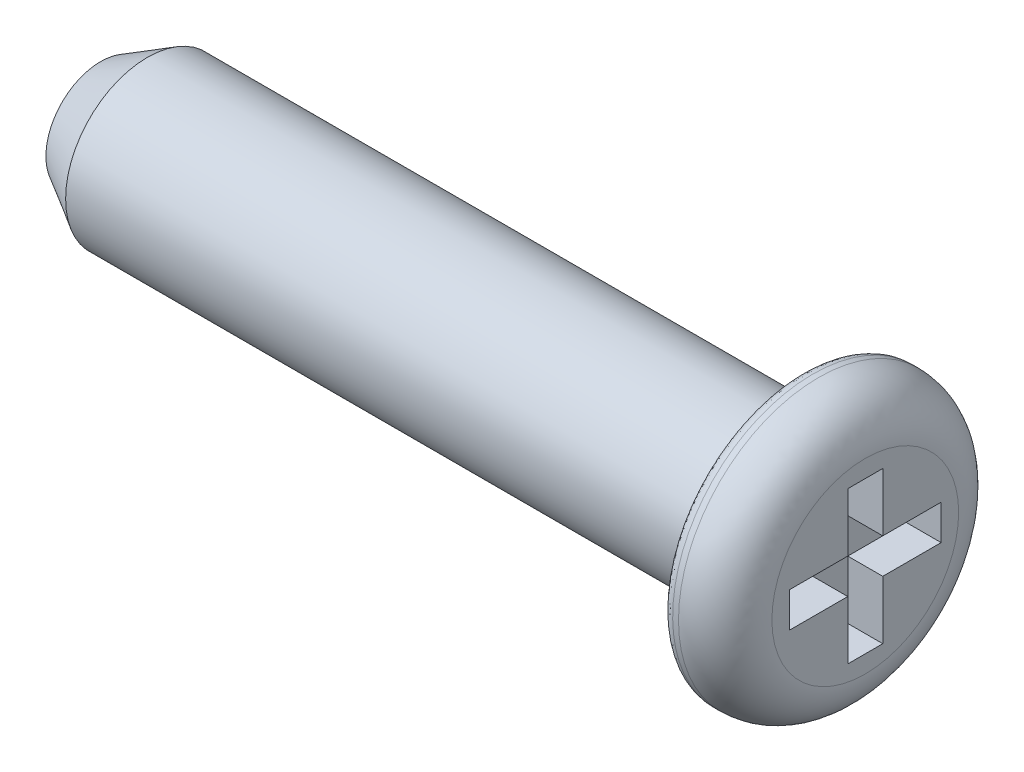
ISO-10303-21;
HEADER;
FILE_DESCRIPTION(('STEP AP214'),'2;1');
FILE_NAME('part.step','',(''),(''),'','','');
FILE_SCHEMA(('AUTOMOTIVE_DESIGN { 1 0 10303 214 1 1 1 1 }'));
ENDSEC;
DATA;
#1=APPLICATION_CONTEXT('core data for automotive mechanical design processes');
#2=APPLICATION_PROTOCOL_DEFINITION('international standard','automotive_design',2000,#1);
#3=PRODUCT_CONTEXT('',#1,'mechanical');
#4=PRODUCT('Part','Part','',(#3));
#5=PRODUCT_RELATED_PRODUCT_CATEGORY('part','',(#4));
#6=PRODUCT_DEFINITION_FORMATION('','',#4);
#7=PRODUCT_DEFINITION_CONTEXT('part definition',#1,'design');
#8=PRODUCT_DEFINITION('design','',#6,#7);
#9=PRODUCT_DEFINITION_SHAPE('','',#8);
#10=(LENGTH_UNIT() NAMED_UNIT(*) SI_UNIT(.MILLI.,.METRE.));
#11=(NAMED_UNIT(*) PLANE_ANGLE_UNIT() SI_UNIT($,.RADIAN.));
#12=(NAMED_UNIT(*) SI_UNIT($,.STERADIAN.) SOLID_ANGLE_UNIT());
#13=UNCERTAINTY_MEASURE_WITH_UNIT(LENGTH_MEASURE(1.E-05),#10,'distance_accuracy_value','');
#14=(GEOMETRIC_REPRESENTATION_CONTEXT(3) GLOBAL_UNCERTAINTY_ASSIGNED_CONTEXT((#13)) GLOBAL_UNIT_ASSIGNED_CONTEXT((#10,
#11,#12)) REPRESENTATION_CONTEXT('',''));
#15=CARTESIAN_POINT('',(0.,0.,0.));
#16=DIRECTION('',(0.,0.,1.));
#17=DIRECTION('',(1.,0.,0.));
#18=AXIS2_PLACEMENT_3D('',#15,#16,#17);
#19=CARTESIAN_POINT('',(6.75,3.024,-5.524));
#20=DIRECTION('',(1.,0.,0.));
#21=DIRECTION('',(0.,0.,-1.));
#22=AXIS2_PLACEMENT_3D('',#19,#20,#21);
#23=PLANE('',#22);
#24=DIRECTION('',(0.,-1.,0.));
#25=VECTOR('',#24,1.);
#26=CARTESIAN_POINT('',(6.75,3.7,-5.55));
#27=LINE('',#26,#25);
#28=CARTESIAN_POINT('',(6.75,3.85,-5.55));
#29=VERTEX_POINT('',#28);
#30=CARTESIAN_POINT('',(6.75,3.55,-5.55));
#31=VERTEX_POINT('',#30);
#32=EDGE_CURVE('E176',#29,#31,#27,.T.);
#33=ORIENTED_EDGE('',*,*,#32,.T.);
#34=DIRECTION('',(0.,0.,-1.));
#35=VECTOR('',#34,1.);
#36=CARTESIAN_POINT('',(6.75,3.55,-5.8));
#37=LINE('',#36,#35);
#38=CARTESIAN_POINT('',(6.75,3.55,-6.05));
#39=VERTEX_POINT('',#38);
#40=EDGE_CURVE('E369',#31,#39,#37,.T.);
#41=ORIENTED_EDGE('',*,*,#40,.T.);
#42=DIRECTION('',(0.,-1.,0.));
#43=VECTOR('',#42,1.);
#44=CARTESIAN_POINT('',(6.75,3.3,-6.05));
#45=LINE('',#44,#43);
#46=CARTESIAN_POINT('',(6.75,3.05,-6.05));
#47=VERTEX_POINT('',#46);
#48=EDGE_CURVE('E362',#39,#47,#45,.T.);
#49=ORIENTED_EDGE('',*,*,#48,.T.);
#50=DIRECTION('',(0.,0.,-1.));
#51=VECTOR('',#50,1.);
#52=CARTESIAN_POINT('',(6.75,3.05,-6.2));
#53=LINE('',#52,#51);
#54=CARTESIAN_POINT('',(6.75,3.05,-6.35));
#55=VERTEX_POINT('',#54);
#56=EDGE_CURVE('E355',#47,#55,#53,.T.);
#57=ORIENTED_EDGE('',*,*,#56,.T.);
#58=DIRECTION('',(0.,1.,0.));
#59=VECTOR('',#58,1.);
#60=CARTESIAN_POINT('',(6.75,3.3,-6.35));
#61=LINE('',#60,#59);
#62=CARTESIAN_POINT('',(6.75,3.55,-6.35));
#63=VERTEX_POINT('',#62);
#64=EDGE_CURVE('E348',#55,#63,#61,.T.);
#65=ORIENTED_EDGE('',*,*,#64,.T.);
#66=DIRECTION('',(0.,0.,-1.));
#67=VECTOR('',#66,1.);
#68=CARTESIAN_POINT('',(6.75,3.55,-6.6));
#69=LINE('',#68,#67);
#70=CARTESIAN_POINT('',(6.75,3.55,-6.85));
#71=VERTEX_POINT('',#70);
#72=EDGE_CURVE('E341',#63,#71,#69,.T.);
#73=ORIENTED_EDGE('',*,*,#72,.T.);
#74=DIRECTION('',(0.,1.,0.));
#75=VECTOR('',#74,1.);
#76=CARTESIAN_POINT('',(6.75,3.7,-6.85));
#77=LINE('',#76,#75);
#78=CARTESIAN_POINT('',(6.75,3.85,-6.85));
#79=VERTEX_POINT('',#78);
#80=EDGE_CURVE('E334',#71,#79,#77,.T.);
#81=ORIENTED_EDGE('',*,*,#80,.T.);
#82=DIRECTION('',(0.,0.,1.));
#83=VECTOR('',#82,1.);
#84=CARTESIAN_POINT('',(6.75,3.85,-6.6));
#85=LINE('',#84,#83);
#86=CARTESIAN_POINT('',(6.75,3.85,-6.35));
#87=VERTEX_POINT('',#86);
#88=EDGE_CURVE('E327',#79,#87,#85,.T.);
#89=ORIENTED_EDGE('',*,*,#88,.T.);
#90=DIRECTION('',(0.,1.,0.));
#91=VECTOR('',#90,1.);
#92=CARTESIAN_POINT('',(6.75,4.1,-6.35));
#93=LINE('',#92,#91);
#94=CARTESIAN_POINT('',(6.75,4.35,-6.35));
#95=VERTEX_POINT('',#94);
#96=EDGE_CURVE('E320',#87,#95,#93,.T.);
#97=ORIENTED_EDGE('',*,*,#96,.T.);
#98=DIRECTION('',(0.,0.,1.));
#99=VECTOR('',#98,1.);
#100=CARTESIAN_POINT('',(6.75,4.35,-6.2));
#101=LINE('',#100,#99);
#102=CARTESIAN_POINT('',(6.75,4.35,-6.05));
#103=VERTEX_POINT('',#102);
#104=EDGE_CURVE('E153',#95,#103,#101,.T.);
#105=ORIENTED_EDGE('',*,*,#104,.T.);
#106=DIRECTION('',(0.,-1.,0.));
#107=VECTOR('',#106,1.);
#108=CARTESIAN_POINT('',(6.75,4.1,-6.05));
#109=LINE('',#108,#107);
#110=CARTESIAN_POINT('',(6.75,3.85,-6.05));
#111=VERTEX_POINT('',#110);
#112=EDGE_CURVE('E150',#103,#111,#109,.T.);
#113=ORIENTED_EDGE('',*,*,#112,.T.);
#114=DIRECTION('',(0.,0.,1.));
#115=VECTOR('',#114,1.);
#116=CARTESIAN_POINT('',(6.75,3.85,-5.8));
#117=LINE('',#116,#115);
#118=EDGE_CURVE('E146',#111,#29,#117,.T.);
#119=ORIENTED_EDGE('',*,*,#118,.T.);
#120=EDGE_LOOP('',(#33,#41,#49,#57,#65,#73,#81,#89,#97,#105,#113,#119));
#121=FACE_BOUND('',#120,.T.);
#122=ADVANCED_FACE('F16',(#121),#23,.T.);
#123=CARTESIAN_POINT('',(6.741146467985,4.36,-6.05));
#124=DIRECTION('',(0.,0.,1.));
#125=DIRECTION('',(0.,-1.,0.));
#126=AXIS2_PLACEMENT_3D('',#123,#124,#125);
#127=PLANE('',#126);
#128=ORIENTED_EDGE('',*,*,#112,.F.);
#129=DIRECTION('',(1.,0.,0.));
#130=VECTOR('',#129,1.);
#131=CARTESIAN_POINT('',(6.9,4.35,-6.05));
#132=LINE('',#131,#130);
#133=CARTESIAN_POINT('',(7.05,4.35,-6.05));
#134=VERTEX_POINT('',#133);
#135=EDGE_CURVE('E306',#103,#134,#132,.T.);
#136=ORIENTED_EDGE('',*,*,#135,.T.);
#137=DIRECTION('',(0.,1.,0.));
#138=VECTOR('',#137,1.);
#139=CARTESIAN_POINT('',(7.05,3.7,-6.05));
#140=LINE('',#139,#138);
#141=CARTESIAN_POINT('',(7.05,3.85,-6.05));
#142=VERTEX_POINT('',#141);
#143=EDGE_CURVE('E162',#134,#142,#140,.F.);
#144=ORIENTED_EDGE('',*,*,#143,.T.);
#145=DIRECTION('',(-1.,0.,0.));
#146=VECTOR('',#145,1.);
#147=CARTESIAN_POINT('',(6.9,3.85,-6.05));
#148=LINE('',#147,#146);
#149=EDGE_CURVE('E157',#142,#111,#148,.T.);
#150=ORIENTED_EDGE('',*,*,#149,.T.);
#151=EDGE_LOOP('',(#128,#136,#144,#150));
#152=FACE_BOUND('',#151,.T.);
#153=ADVANCED_FACE('F160',(#152),#127,.F.);
#154=CARTESIAN_POINT('',(6.741146467985,3.85,-6.06));
#155=DIRECTION('',(0.,1.,0.));
#156=DIRECTION('',(0.,0.,1.));
#157=AXIS2_PLACEMENT_3D('',#154,#155,#156);
#158=PLANE('',#157);
#159=ORIENTED_EDGE('',*,*,#118,.F.);
#160=ORIENTED_EDGE('',*,*,#149,.F.);
#161=DIRECTION('',(0.,0.,-1.));
#162=VECTOR('',#161,1.);
#163=CARTESIAN_POINT('',(7.05,3.85,-6.2));
#164=LINE('',#163,#162);
#165=CARTESIAN_POINT('',(7.05,3.85,-5.55));
#166=VERTEX_POINT('',#165);
#167=EDGE_CURVE('E431',#142,#166,#164,.F.);
#168=ORIENTED_EDGE('',*,*,#167,.T.);
#169=DIRECTION('',(-1.,0.,0.));
#170=VECTOR('',#169,1.);
#171=CARTESIAN_POINT('',(6.9,3.85,-5.55));
#172=LINE('',#171,#170);
#173=EDGE_CURVE('E169',#166,#29,#172,.T.);
#174=ORIENTED_EDGE('',*,*,#173,.T.);
#175=EDGE_LOOP('',(#159,#160,#168,#174));
#176=FACE_BOUND('',#175,.T.);
#177=ADVANCED_FACE('F167',(#176),#158,.F.);
#178=CARTESIAN_POINT('',(6.741146467985,3.858853532015,-5.55));
#179=DIRECTION('',(0.,0.,1.));
#180=DIRECTION('',(0.,-1.,0.));
#181=AXIS2_PLACEMENT_3D('',#178,#179,#180);
#182=PLANE('',#181);
#183=ORIENTED_EDGE('',*,*,#32,.F.);
#184=ORIENTED_EDGE('',*,*,#173,.F.);
#185=DIRECTION('',(0.,1.,0.));
#186=VECTOR('',#185,1.);
#187=CARTESIAN_POINT('',(7.05,3.7,-5.55));
#188=LINE('',#187,#186);
#189=CARTESIAN_POINT('',(7.05,3.55,-5.55));
#190=VERTEX_POINT('',#189);
#191=EDGE_CURVE('E381',#166,#190,#188,.F.);
#192=ORIENTED_EDGE('',*,*,#191,.T.);
#193=DIRECTION('',(-1.,0.,0.));
#194=VECTOR('',#193,1.);
#195=CARTESIAN_POINT('',(6.9,3.55,-5.55));
#196=LINE('',#195,#194);
#197=EDGE_CURVE('E372',#190,#31,#196,.T.);
#198=ORIENTED_EDGE('',*,*,#197,.T.);
#199=EDGE_LOOP('',(#183,#184,#192,#198));
#200=FACE_BOUND('',#199,.T.);
#201=ADVANCED_FACE('F379',(#200),#182,.F.);
#202=CARTESIAN_POINT('',(6.741146467985,3.55,-5.54));
#203=DIRECTION('',(0.,-1.,0.));
#204=DIRECTION('',(0.,0.,-1.));
#205=AXIS2_PLACEMENT_3D('',#202,#203,#204);
#206=PLANE('',#205);
#207=ORIENTED_EDGE('',*,*,#40,.F.);
#208=ORIENTED_EDGE('',*,*,#197,.F.);
#209=DIRECTION('',(0.,0.,1.));
#210=VECTOR('',#209,1.);
#211=CARTESIAN_POINT('',(7.05,3.55,-6.2));
#212=LINE('',#211,#210);
#213=CARTESIAN_POINT('',(7.05,3.55,-6.05));
#214=VERTEX_POINT('',#213);
#215=EDGE_CURVE('E387',#190,#214,#212,.F.);
#216=ORIENTED_EDGE('',*,*,#215,.T.);
#217=DIRECTION('',(-1.,0.,0.));
#218=VECTOR('',#217,1.);
#219=CARTESIAN_POINT('',(6.9,3.55,-6.05));
#220=LINE('',#219,#218);
#221=EDGE_CURVE('E365',#214,#39,#220,.T.);
#222=ORIENTED_EDGE('',*,*,#221,.T.);
#223=EDGE_LOOP('',(#207,#208,#216,#222));
#224=FACE_BOUND('',#223,.T.);
#225=ADVANCED_FACE('F384',(#224),#206,.F.);
#226=CARTESIAN_POINT('',(6.741146467985,3.56,-6.05));
#227=DIRECTION('',(0.,0.,1.));
#228=DIRECTION('',(0.,-1.,0.));
#229=AXIS2_PLACEMENT_3D('',#226,#227,#228);
#230=PLANE('',#229);
#231=ORIENTED_EDGE('',*,*,#48,.F.);
#232=ORIENTED_EDGE('',*,*,#221,.F.);
#233=DIRECTION('',(0.,1.,0.));
#234=VECTOR('',#233,1.);
#235=CARTESIAN_POINT('',(7.05,3.7,-6.05));
#236=LINE('',#235,#234);
#237=CARTESIAN_POINT('',(7.05,3.05,-6.05));
#238=VERTEX_POINT('',#237);
#239=EDGE_CURVE('E440',#214,#238,#236,.F.);
#240=ORIENTED_EDGE('',*,*,#239,.T.);
#241=DIRECTION('',(-1.,0.,0.));
#242=VECTOR('',#241,1.);
#243=CARTESIAN_POINT('',(6.9,3.05,-6.05));
#244=LINE('',#243,#242);
#245=EDGE_CURVE('E358',#238,#47,#244,.T.);
#246=ORIENTED_EDGE('',*,*,#245,.T.);
#247=EDGE_LOOP('',(#231,#232,#240,#246));
#248=FACE_BOUND('',#247,.T.);
#249=ADVANCED_FACE('F390',(#248),#230,.F.);
#250=CARTESIAN_POINT('',(6.741146467985,3.05,-6.041146467985));
#251=DIRECTION('',(0.,-1.,0.));
#252=DIRECTION('',(0.,0.,-1.));
#253=AXIS2_PLACEMENT_3D('',#250,#251,#252);
#254=PLANE('',#253);
#255=ORIENTED_EDGE('',*,*,#56,.F.);
#256=ORIENTED_EDGE('',*,*,#245,.F.);
#257=DIRECTION('',(0.,0.,1.));
#258=VECTOR('',#257,1.);
#259=CARTESIAN_POINT('',(7.05,3.05,-6.2));
#260=LINE('',#259,#258);
#261=CARTESIAN_POINT('',(7.05,3.05,-6.35));
#262=VERTEX_POINT('',#261);
#263=EDGE_CURVE('E398',#238,#262,#260,.F.);
#264=ORIENTED_EDGE('',*,*,#263,.T.);
#265=DIRECTION('',(-1.,0.,0.));
#266=VECTOR('',#265,1.);
#267=CARTESIAN_POINT('',(6.9,3.05,-6.35));
#268=LINE('',#267,#266);
#269=EDGE_CURVE('E351',#262,#55,#268,.T.);
#270=ORIENTED_EDGE('',*,*,#269,.T.);
#271=EDGE_LOOP('',(#255,#256,#264,#270));
#272=FACE_BOUND('',#271,.T.);
#273=ADVANCED_FACE('F396',(#272),#254,.F.);
#274=CARTESIAN_POINT('',(6.741146467985,3.04,-6.35));
#275=DIRECTION('',(0.,0.,-1.));
#276=DIRECTION('',(0.,1.,0.));
#277=AXIS2_PLACEMENT_3D('',#274,#275,#276);
#278=PLANE('',#277);
#279=ORIENTED_EDGE('',*,*,#64,.F.);
#280=ORIENTED_EDGE('',*,*,#269,.F.);
#281=DIRECTION('',(0.,-1.,0.));
#282=VECTOR('',#281,1.);
#283=CARTESIAN_POINT('',(7.05,3.7,-6.35));
#284=LINE('',#283,#282);
#285=CARTESIAN_POINT('',(7.05,3.55,-6.35));
#286=VERTEX_POINT('',#285);
#287=EDGE_CURVE('E404',#262,#286,#284,.F.);
#288=ORIENTED_EDGE('',*,*,#287,.T.);
#289=DIRECTION('',(-1.,0.,0.));
#290=VECTOR('',#289,1.);
#291=CARTESIAN_POINT('',(6.9,3.55,-6.35));
#292=LINE('',#291,#290);
#293=EDGE_CURVE('E344',#286,#63,#292,.T.);
#294=ORIENTED_EDGE('',*,*,#293,.T.);
#295=EDGE_LOOP('',(#279,#280,#288,#294));
#296=FACE_BOUND('',#295,.T.);
#297=ADVANCED_FACE('F401',(#296),#278,.F.);
#298=CARTESIAN_POINT('',(6.741146467985,3.55,-6.34));
#299=DIRECTION('',(0.,-1.,0.));
#300=DIRECTION('',(0.,0.,-1.));
#301=AXIS2_PLACEMENT_3D('',#298,#299,#300);
#302=PLANE('',#301);
#303=ORIENTED_EDGE('',*,*,#72,.F.);
#304=ORIENTED_EDGE('',*,*,#293,.F.);
#305=DIRECTION('',(0.,0.,1.));
#306=VECTOR('',#305,1.);
#307=CARTESIAN_POINT('',(7.05,3.55,-6.2));
#308=LINE('',#307,#306);
#309=CARTESIAN_POINT('',(7.05,3.55,-6.85));
#310=VERTEX_POINT('',#309);
#311=EDGE_CURVE('E447',#286,#310,#308,.F.);
#312=ORIENTED_EDGE('',*,*,#311,.T.);
#313=DIRECTION('',(-1.,0.,0.));
#314=VECTOR('',#313,1.);
#315=CARTESIAN_POINT('',(6.9,3.55,-6.85));
#316=LINE('',#315,#314);
#317=EDGE_CURVE('E337',#310,#71,#316,.T.);
#318=ORIENTED_EDGE('',*,*,#317,.T.);
#319=EDGE_LOOP('',(#303,#304,#312,#318));
#320=FACE_BOUND('',#319,.T.);
#321=ADVANCED_FACE('F407',(#320),#302,.F.);
#322=CARTESIAN_POINT('',(6.741146467985,3.541146467985,-6.85));
#323=DIRECTION('',(0.,0.,-1.));
#324=DIRECTION('',(0.,1.,0.));
#325=AXIS2_PLACEMENT_3D('',#322,#323,#324);
#326=PLANE('',#325);
#327=ORIENTED_EDGE('',*,*,#80,.F.);
#328=ORIENTED_EDGE('',*,*,#317,.F.);
#329=DIRECTION('',(0.,-1.,0.));
#330=VECTOR('',#329,1.);
#331=CARTESIAN_POINT('',(7.05,3.7,-6.85));
#332=LINE('',#331,#330);
#333=CARTESIAN_POINT('',(7.05,3.85,-6.85));
#334=VERTEX_POINT('',#333);
#335=EDGE_CURVE('E415',#310,#334,#332,.F.);
#336=ORIENTED_EDGE('',*,*,#335,.T.);
#337=DIRECTION('',(-1.,0.,0.));
#338=VECTOR('',#337,1.);
#339=CARTESIAN_POINT('',(6.9,3.85,-6.85));
#340=LINE('',#339,#338);
#341=EDGE_CURVE('E330',#334,#79,#340,.T.);
#342=ORIENTED_EDGE('',*,*,#341,.T.);
#343=EDGE_LOOP('',(#327,#328,#336,#342));
#344=FACE_BOUND('',#343,.T.);
#345=ADVANCED_FACE('F413',(#344),#326,.F.);
#346=CARTESIAN_POINT('',(6.741146467985,3.85,-6.86));
#347=DIRECTION('',(0.,1.,0.));
#348=DIRECTION('',(0.,0.,1.));
#349=AXIS2_PLACEMENT_3D('',#346,#347,#348);
#350=PLANE('',#349);
#351=ORIENTED_EDGE('',*,*,#88,.F.);
#352=ORIENTED_EDGE('',*,*,#341,.F.);
#353=DIRECTION('',(0.,0.,-1.));
#354=VECTOR('',#353,1.);
#355=CARTESIAN_POINT('',(7.05,3.85,-6.2));
#356=LINE('',#355,#354);
#357=CARTESIAN_POINT('',(7.05,3.85,-6.35));
#358=VERTEX_POINT('',#357);
#359=EDGE_CURVE('E421',#334,#358,#356,.F.);
#360=ORIENTED_EDGE('',*,*,#359,.T.);
#361=DIRECTION('',(-1.,0.,0.));
#362=VECTOR('',#361,1.);
#363=CARTESIAN_POINT('',(6.9,3.85,-6.35));
#364=LINE('',#363,#362);
#365=EDGE_CURVE('E323',#358,#87,#364,.T.);
#366=ORIENTED_EDGE('',*,*,#365,.T.);
#367=EDGE_LOOP('',(#351,#352,#360,#366));
#368=FACE_BOUND('',#367,.T.);
#369=ADVANCED_FACE('F418',(#368),#350,.F.);
#370=CARTESIAN_POINT('',(6.741146467985,3.84,-6.35));
#371=DIRECTION('',(0.,0.,-1.));
#372=DIRECTION('',(0.,1.,0.));
#373=AXIS2_PLACEMENT_3D('',#370,#371,#372);
#374=PLANE('',#373);
#375=ORIENTED_EDGE('',*,*,#96,.F.);
#376=ORIENTED_EDGE('',*,*,#365,.F.);
#377=DIRECTION('',(0.,-1.,0.));
#378=VECTOR('',#377,1.);
#379=CARTESIAN_POINT('',(7.05,3.7,-6.35));
#380=LINE('',#379,#378);
#381=CARTESIAN_POINT('',(7.05,4.35,-6.35));
#382=VERTEX_POINT('',#381);
#383=EDGE_CURVE('E426',#358,#382,#380,.F.);
#384=ORIENTED_EDGE('',*,*,#383,.T.);
#385=DIRECTION('',(-1.,0.,0.));
#386=VECTOR('',#385,1.);
#387=CARTESIAN_POINT('',(6.9,4.35,-6.35));
#388=LINE('',#387,#386);
#389=EDGE_CURVE('E316',#382,#95,#388,.T.);
#390=ORIENTED_EDGE('',*,*,#389,.T.);
#391=EDGE_LOOP('',(#375,#376,#384,#390));
#392=FACE_BOUND('',#391,.T.);
#393=ADVANCED_FACE('F424',(#392),#374,.F.);
#394=CARTESIAN_POINT('',(6.741146467985,4.35,-6.358853532015));
#395=DIRECTION('',(0.,1.,0.));
#396=DIRECTION('',(0.,0.,1.));
#397=AXIS2_PLACEMENT_3D('',#394,#395,#396);
#398=PLANE('',#397);
#399=ORIENTED_EDGE('',*,*,#104,.F.);
#400=ORIENTED_EDGE('',*,*,#389,.F.);
#401=DIRECTION('',(0.,0.,-1.));
#402=VECTOR('',#401,1.);
#403=CARTESIAN_POINT('',(7.05,4.35,-6.2));
#404=LINE('',#403,#402);
#405=EDGE_CURVE('E289',#382,#134,#404,.F.);
#406=ORIENTED_EDGE('',*,*,#405,.T.);
#407=ORIENTED_EDGE('',*,*,#135,.F.);
#408=EDGE_LOOP('',(#399,#400,#406,#407));
#409=FACE_BOUND('',#408,.T.);
#410=ADVANCED_FACE('F200',(#409),#398,.F.);
#411=CARTESIAN_POINT('',(7.05,2.867166420633,-5.368));
#412=DIRECTION('',(1.,0.,0.));
#413=DIRECTION('',(0.,0.,-1.));
#414=AXIS2_PLACEMENT_3D('',#411,#412,#413);
#415=PLANE('',#414);
#416=ORIENTED_EDGE('',*,*,#383,.F.);
#417=ORIENTED_EDGE('',*,*,#359,.F.);
#418=ORIENTED_EDGE('',*,*,#335,.F.);
#419=ORIENTED_EDGE('',*,*,#311,.F.);
#420=ORIENTED_EDGE('',*,*,#287,.F.);
#421=ORIENTED_EDGE('',*,*,#263,.F.);
#422=ORIENTED_EDGE('',*,*,#239,.F.);
#423=ORIENTED_EDGE('',*,*,#215,.F.);
#424=ORIENTED_EDGE('',*,*,#191,.F.);
#425=ORIENTED_EDGE('',*,*,#167,.F.);
#426=ORIENTED_EDGE('',*,*,#143,.F.);
#427=ORIENTED_EDGE('',*,*,#405,.F.);
#428=EDGE_LOOP('',(#416,#417,#418,#419,#420,#421,#422,#423,#424,#425,#426,#427));
#429=FACE_BOUND('',#428,.T.);
#430=CARTESIAN_POINT('',(7.05000000000001,3.7,-6.2));
#431=DIRECTION('',(-1.,0.,0.));
#432=DIRECTION('',(0.,0.,-1.));
#433=AXIS2_PLACEMENT_3D('',#430,#431,#432);
#434=CIRCLE('',#433,0.799999991004701);
#435=CARTESIAN_POINT('',(7.05000000000001,3.69999999999999,-5.4000000080958));
#436=VERTEX_POINT('',#435);
#437=CARTESIAN_POINT('',(7.05000000000001,3.70000000000002,-6.9999999919042));
#438=VERTEX_POINT('',#437);
#439=EDGE_CURVE('E183',#436,#438,#434,.F.);
#440=ORIENTED_EDGE('',*,*,#439,.T.);
#441=CARTESIAN_POINT('',(7.05000000000001,3.7,-6.2));
#442=DIRECTION('',(-1.,0.,0.));
#443=DIRECTION('',(0.,0.,1.));
#444=AXIS2_PLACEMENT_3D('',#441,#442,#443);
#445=CIRCLE('',#444,0.799999991004699);
#446=EDGE_CURVE('E284',#438,#436,#445,.F.);
#447=ORIENTED_EDGE('',*,*,#446,.T.);
#448=EDGE_LOOP('',(#440,#447));
#449=FACE_BOUND('',#448,.T.);
#450=ADVANCED_FACE('F190',(#429,#449),#415,.T.);
#451=CARTESIAN_POINT('',(6.63743568920142,3.68865757276304,-7.39974900946468));
#452=CARTESIAN_POINT('',(6.88347384142366,3.68858447708785,-7.40748072879281));
#453=CARTESIAN_POINT('',(7.05753489804068,3.69022997827261,-7.2334272942651));
#454=CARTESIAN_POINT('',(7.04980261265878,3.69255591897725,-6.98740014344981));
#455=(BOUNDED_CURVE() B_SPLINE_CURVE(3,(#451,#452,#453,#454),.UNSPECIFIED.,.F.,
.F.) B_SPLINE_CURVE_WITH_KNOTS((4,4),(0.,1.),
.UNSPECIFIED.) CURVE() GEOMETRIC_REPRESENTATION_ITEM() RATIONAL_B_SPLINE_CURVE((1.,
0.789697844101267,0.789697844101267,1.)) REPRESENTATION_ITEM(''));
#456=CARTESIAN_POINT('',(6.65,3.7,-6.2));
#457=DIRECTION('',(1.,0.,0.));
#458=AXIS1_PLACEMENT('',#456,#457);
#459=SURFACE_OF_REVOLUTION('',#455,#458);
#460=CARTESIAN_POINT('',(6.65,3.7,-6.2));
#461=DIRECTION('',(1.,0.,0.));
#462=DIRECTION('',(0.,0.,-1.));
#463=AXIS2_PLACEMENT_3D('',#460,#461,#462);
#464=CIRCLE('',#463,1.2);
#465=CARTESIAN_POINT('',(6.65,3.7,-7.4));
#466=VERTEX_POINT('',#465);
#467=EDGE_CURVE('E280',#466,#466,#464,.T.);
#468=ORIENTED_EDGE('',*,*,#467,.T.);
#469=EDGE_LOOP('',(#468));
#470=FACE_BOUND('',#469,.T.);
#471=ORIENTED_EDGE('',*,*,#439,.F.);
#472=ORIENTED_EDGE('',*,*,#446,.F.);
#473=EDGE_LOOP('',(#471,#472));
#474=FACE_BOUND('',#473,.T.);
#475=ADVANCED_FACE('F199',(#470,#474),#459,.T.);
#476=CARTESIAN_POINT('',(6.6,3.7,-6.2));
#477=DIRECTION('',(1.,0.,0.));
#478=DIRECTION('',(0.,1.,0.));
#479=AXIS2_PLACEMENT_3D('',#476,#477,#478);
#480=CYLINDRICAL_SURFACE('',#479,1.2);
#481=CARTESIAN_POINT('',(6.6,3.7,-6.2));
#482=DIRECTION('',(1.,0.,0.));
#483=DIRECTION('',(0.,-0.0134291293990491,0.999909825176042));
#484=AXIS2_PLACEMENT_3D('',#481,#482,#483);
#485=CIRCLE('',#484,1.20000000000035);
#486=CARTESIAN_POINT('',(6.6,3.68388504472114,-5.0001082097884));
#487=VERTEX_POINT('',#486);
#488=EDGE_CURVE('E276',#487,#487,#485,.T.);
#489=ORIENTED_EDGE('',*,*,#488,.T.);
#490=EDGE_LOOP('',(#489));
#491=FACE_BOUND('',#490,.T.);
#492=ORIENTED_EDGE('',*,*,#467,.F.);
#493=EDGE_LOOP('',(#492));
#494=FACE_BOUND('',#493,.T.);
#495=ADVANCED_FACE('F252',(#491,#494),#480,.T.);
#496=CARTESIAN_POINT('',(6.50039170687413,3.68534670332098,-5.10894078944785));
#497=CARTESIAN_POINT('',(6.49445300850722,3.68444831367663,-5.04204824522114));
#498=CARTESIAN_POINT('',(6.54194336804711,3.68381055677614,-4.99456196581039));
#499=CARTESIAN_POINT('',(6.60884197014127,3.68389030449755,-5.00049984367342));
#500=(BOUNDED_CURVE() B_SPLINE_CURVE(3,(#496,#497,#498,#499),.UNSPECIFIED.,.F.,
.F.) B_SPLINE_CURVE_WITH_KNOTS((4,4),(0.,1.),
.UNSPECIFIED.) CURVE() GEOMETRIC_REPRESENTATION_ITEM() RATIONAL_B_SPLINE_CURVE((1.,
0.761208971798789,0.761208971798789,1.)) REPRESENTATION_ITEM(''));
#501=CARTESIAN_POINT('',(6.6,3.7,-6.2));
#502=DIRECTION('',(1.,0.,0.));
#503=AXIS1_PLACEMENT('',#501,#502);
#504=SURFACE_OF_REVOLUTION('',#500,#503);
#505=ORIENTED_EDGE('',*,*,#488,.F.);
#506=EDGE_LOOP('',(#505));
#507=FACE_BOUND('',#506,.T.);
#508=CARTESIAN_POINT('',(6.5,3.7,-6.2));
#509=DIRECTION('',(1.,0.,0.));
#510=DIRECTION('',(0.,0.,1.));
#511=AXIS2_PLACEMENT_3D('',#508,#509,#510);
#512=CIRCLE('',#511,1.09999998207468);
#513=CARTESIAN_POINT('',(6.5,3.69999999999998,-5.10000002509559));
#514=VERTEX_POINT('',#513);
#515=CARTESIAN_POINT('',(6.5,3.70000000000001,-7.29999997490441));
#516=VERTEX_POINT('',#515);
#517=EDGE_CURVE('E40',#514,#516,#512,.T.);
#518=ORIENTED_EDGE('',*,*,#517,.T.);
#519=CARTESIAN_POINT('',(6.5,3.7,-6.2));
#520=DIRECTION('',(1.,0.,0.));
#521=DIRECTION('',(0.,0.,-1.));
#522=AXIS2_PLACEMENT_3D('',#519,#520,#521);
#523=CIRCLE('',#522,1.09999998207468);
#524=EDGE_CURVE('E225',#516,#514,#523,.T.);
#525=ORIENTED_EDGE('',*,*,#524,.T.);
#526=EDGE_LOOP('',(#518,#525));
#527=FACE_BOUND('',#526,.T.);
#528=ADVANCED_FACE('F241',(#507,#527),#504,.T.);
#529=CARTESIAN_POINT('',(6.5,2.555999997477,-5.056));
#530=DIRECTION('',(1.,0.,0.));
#531=DIRECTION('',(0.,0.,-1.));
#532=AXIS2_PLACEMENT_3D('',#529,#530,#531);
#533=PLANE('',#532);
#534=CARTESIAN_POINT('',(6.5,3.7,-6.2));
#535=DIRECTION('',(-1.,0.,0.));
#536=DIRECTION('',(0.,0.,1.));
#537=AXIS2_PLACEMENT_3D('',#534,#535,#536);
#538=CIRCLE('',#537,0.7);
#539=CARTESIAN_POINT('',(6.5,3.7,-5.5));
#540=VERTEX_POINT('',#539);
#541=EDGE_CURVE('E234',#540,#540,#538,.F.);
#542=ORIENTED_EDGE('',*,*,#541,.T.);
#543=EDGE_LOOP('',(#542));
#544=FACE_BOUND('',#543,.T.);
#545=ORIENTED_EDGE('',*,*,#517,.F.);
#546=ORIENTED_EDGE('',*,*,#524,.F.);
#547=EDGE_LOOP('',(#545,#546));
#548=FACE_BOUND('',#547,.T.);
#549=ADVANCED_FACE('F203',(#544,#548),#533,.F.);
#550=CARTESIAN_POINT('',(6.5,3.7,-6.2));
#551=DIRECTION('',(-1.,0.,0.));
#552=DIRECTION('',(0.,0.,1.));
#553=AXIS2_PLACEMENT_3D('',#550,#551,#552);
#554=CYLINDRICAL_SURFACE('',#553,0.7);
#555=CARTESIAN_POINT('',(0.899999999999792,3.7,-6.2));
#556=DIRECTION('',(-1.,0.,0.));
#557=DIRECTION('',(0.,-1.,0.));
#558=AXIS2_PLACEMENT_3D('',#555,#556,#557);
#559=CIRCLE('',#558,0.70000000000036);
#560=CARTESIAN_POINT('',(0.899999999999792,2.99999999999964,-6.2));
#561=VERTEX_POINT('',#560);
#562=EDGE_CURVE('E29',#561,#561,#559,.F.);
#563=ORIENTED_EDGE('',*,*,#562,.T.);
#564=EDGE_LOOP('',(#563));
#565=FACE_BOUND('',#564,.T.);
#566=ORIENTED_EDGE('',*,*,#541,.F.);
#567=EDGE_LOOP('',(#566));
#568=FACE_BOUND('',#567,.T.);
#569=ADVANCED_FACE('F254',(#565,#568),#554,.T.);
#570=CARTESIAN_POINT('',(0.899999999999792,3.7,-6.2));
#571=DIRECTION('',(1.,0.,0.));
#572=DIRECTION('',(0.,0.,-1.));
#573=AXIS2_PLACEMENT_3D('',#570,#571,#572);
#574=CONICAL_SURFACE('',#573,0.700000000000361,0.523598775598507);
#575=ORIENTED_EDGE('',*,*,#562,.F.);
#576=EDGE_LOOP('',(#575));
#577=FACE_BOUND('',#576,.T.);
#578=CARTESIAN_POINT('',(0.499999999999818,3.7,-6.2));
#579=DIRECTION('',(1.,0.,0.));
#580=DIRECTION('',(0.,0.,-1.));
#581=AXIS2_PLACEMENT_3D('',#578,#579,#580);
#582=CIRCLE('',#581,0.469059892324415);
#583=CARTESIAN_POINT('',(0.499999999999818,3.7,-6.66905989232442));
#584=VERTEX_POINT('',#583);
#585=EDGE_CURVE('E11',#584,#584,#582,.T.);
#586=ORIENTED_EDGE('',*,*,#585,.T.);
#587=EDGE_LOOP('',(#586));
#588=FACE_BOUND('',#587,.T.);
#589=ADVANCED_FACE('F466',(#577,#588),#574,.T.);
#590=CARTESIAN_POINT('',(0.5,4.187822288017,-6.687822288017));
#591=DIRECTION('',(-1.,0.,0.));
#592=DIRECTION('',(0.,-1.,0.));
#593=AXIS2_PLACEMENT_3D('',#590,#591,#592);
#594=PLANE('',#593);
#595=ORIENTED_EDGE('',*,*,#585,.F.);
#596=EDGE_LOOP('',(#595));
#597=FACE_BOUND('',#596,.T.);
#598=ADVANCED_FACE('F18',(#597),#594,.T.);
#599=CLOSED_SHELL('',(#122,#153,#177,#201,#225,#249,#273,#297,#321,#345,#369,#393,#410,#450,
#475,#495,#528,#549,#569,#589,#598));
#600=MANIFOLD_SOLID_BREP('B1',#599);
#601=ADVANCED_BREP_SHAPE_REPRESENTATION('',(#18,#600),#14);
#602=SHAPE_DEFINITION_REPRESENTATION(#9,#601);
ENDSEC;
END-ISO-10303-21;
